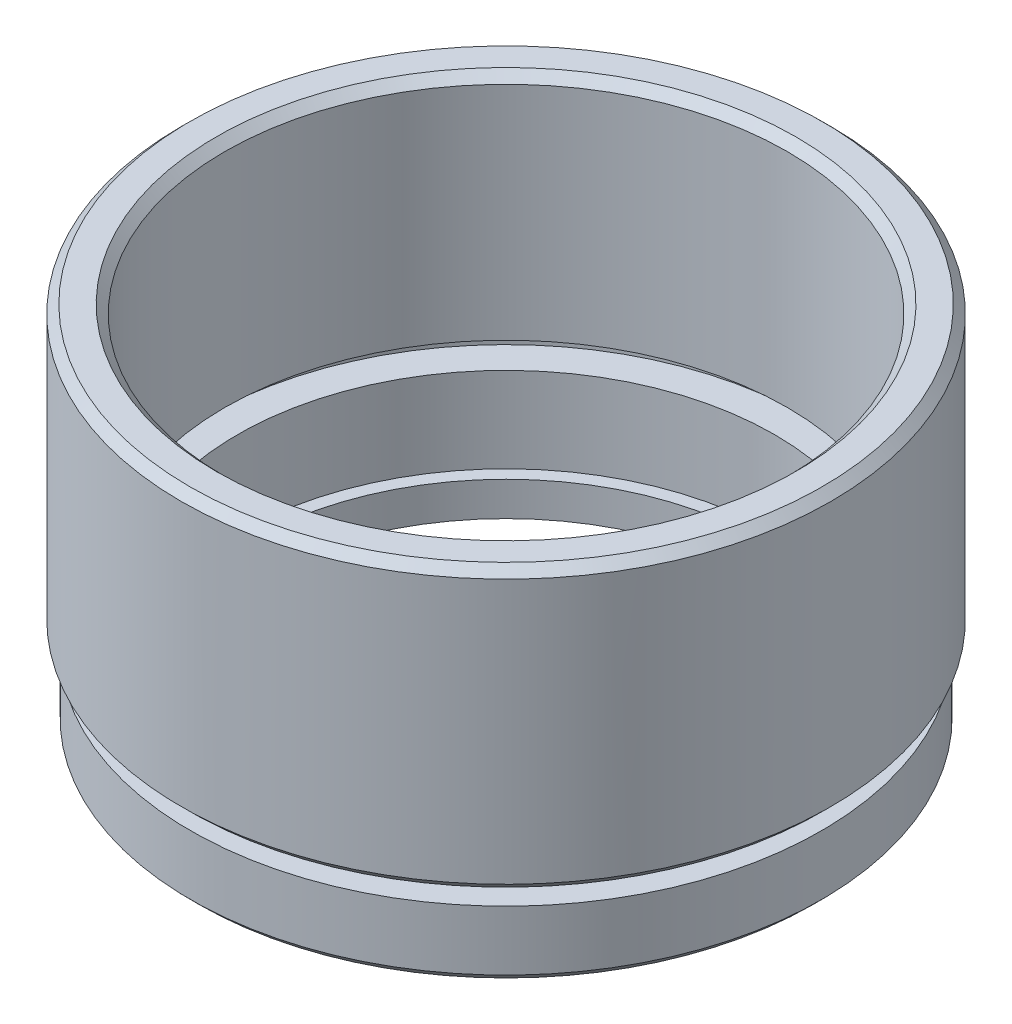
ISO-10303-21;
HEADER;
FILE_DESCRIPTION(('STEP AP214'),'2;1');
FILE_NAME('part.step','',(''),(''),'','','');
FILE_SCHEMA(('AUTOMOTIVE_DESIGN { 1 0 10303 214 1 1 1 1 }'));
ENDSEC;
DATA;
#1=APPLICATION_CONTEXT('core data for automotive mechanical design processes');
#2=APPLICATION_PROTOCOL_DEFINITION('international standard','automotive_design',2000,#1);
#3=PRODUCT_CONTEXT('',#1,'mechanical');
#4=PRODUCT('Part','Part','',(#3));
#5=PRODUCT_RELATED_PRODUCT_CATEGORY('part','',(#4));
#6=PRODUCT_DEFINITION_FORMATION('','',#4);
#7=PRODUCT_DEFINITION_CONTEXT('part definition',#1,'design');
#8=PRODUCT_DEFINITION('design','',#6,#7);
#9=PRODUCT_DEFINITION_SHAPE('','',#8);
#10=(LENGTH_UNIT() NAMED_UNIT(*) SI_UNIT(.MILLI.,.METRE.));
#11=(NAMED_UNIT(*) PLANE_ANGLE_UNIT() SI_UNIT($,.RADIAN.));
#12=(NAMED_UNIT(*) SI_UNIT($,.STERADIAN.) SOLID_ANGLE_UNIT());
#13=UNCERTAINTY_MEASURE_WITH_UNIT(LENGTH_MEASURE(1.E-05),#10,'distance_accuracy_value','');
#14=(GEOMETRIC_REPRESENTATION_CONTEXT(3) GLOBAL_UNCERTAINTY_ASSIGNED_CONTEXT((#13)) GLOBAL_UNIT_ASSIGNED_CONTEXT((#10,
#11,#12)) REPRESENTATION_CONTEXT('',''));
#15=CARTESIAN_POINT('',(0.,0.,0.));
#16=DIRECTION('',(0.,0.,1.));
#17=DIRECTION('',(1.,0.,0.));
#18=AXIS2_PLACEMENT_3D('',#15,#16,#17);
#19=CARTESIAN_POINT('',(0.,0.,0.));
#20=DIRECTION('',(0.,-1.,0.));
#21=DIRECTION('',(0.,0.,-1.));
#22=AXIS2_PLACEMENT_3D('',#19,#20,#21);
#23=CYLINDRICAL_SURFACE('',#22,15.);
#24=CARTESIAN_POINT('',(0.,0.,0.));
#25=DIRECTION('',(0.,-1.,0.));
#26=DIRECTION('',(0.,0.,-1.));
#27=AXIS2_PLACEMENT_3D('',#24,#25,#26);
#28=CIRCLE('',#27,15.);
#29=CARTESIAN_POINT('',(0.,0.,-15.));
#30=VERTEX_POINT('',#29);
#31=EDGE_CURVE('E67',#30,#30,#28,.T.);
#32=ORIENTED_EDGE('',*,*,#31,.T.);
#33=EDGE_LOOP('',(#32));
#34=FACE_BOUND('',#33,.T.);
#35=CARTESIAN_POINT('',(0.,2.,0.));
#36=DIRECTION('',(0.,-1.,0.));
#37=DIRECTION('',(0.,0.,-1.));
#38=AXIS2_PLACEMENT_3D('',#35,#36,#37);
#39=CIRCLE('',#38,15.);
#40=CARTESIAN_POINT('',(0.,2.,-15.));
#41=VERTEX_POINT('',#40);
#42=EDGE_CURVE('E94',#41,#41,#39,.T.);
#43=ORIENTED_EDGE('',*,*,#42,.F.);
#44=EDGE_LOOP('',(#43));
#45=FACE_BOUND('',#44,.T.);
#46=ADVANCED_FACE('F35',(#34,#45),#23,.F.);
#47=CARTESIAN_POINT('',(15.,0.,0.));
#48=DIRECTION('',(0.,-1.,0.));
#49=DIRECTION('',(0.,0.,-1.));
#50=AXIS2_PLACEMENT_3D('',#47,#48,#49);
#51=PLANE('',#50);
#52=CARTESIAN_POINT('',(0.,0.,0.));
#53=DIRECTION('',(0.,-1.,0.));
#54=DIRECTION('',(0.,0.,-1.));
#55=AXIS2_PLACEMENT_3D('',#52,#53,#54);
#56=CIRCLE('',#55,18.);
#57=CARTESIAN_POINT('',(0.,0.,-18.));
#58=VERTEX_POINT('',#57);
#59=EDGE_CURVE('E42',#58,#58,#56,.T.);
#60=ORIENTED_EDGE('',*,*,#59,.T.);
#61=EDGE_LOOP('',(#60));
#62=FACE_BOUND('',#61,.T.);
#63=ORIENTED_EDGE('',*,*,#31,.F.);
#64=EDGE_LOOP('',(#63));
#65=FACE_BOUND('',#64,.T.);
#66=ADVANCED_FACE('F102',(#62,#65),#51,.T.);
#67=CARTESIAN_POINT('',(0.,0.,0.));
#68=DIRECTION('',(0.,-1.,0.));
#69=DIRECTION('',(0.,0.,-1.));
#70=AXIS2_PLACEMENT_3D('',#67,#68,#69);
#71=CYLINDRICAL_SURFACE('',#70,18.5);
#72=CARTESIAN_POINT('',(0.,0.500000000000004,0.));
#73=DIRECTION('',(0.,-1.,0.));
#74=DIRECTION('',(0.,0.,-1.));
#75=AXIS2_PLACEMENT_3D('',#72,#73,#74);
#76=CIRCLE('',#75,18.5);
#77=CARTESIAN_POINT('',(0.,0.500000000000004,-18.5));
#78=VERTEX_POINT('',#77);
#79=EDGE_CURVE('E10',#78,#78,#76,.F.);
#80=ORIENTED_EDGE('',*,*,#79,.T.);
#81=EDGE_LOOP('',(#80));
#82=FACE_BOUND('',#81,.T.);
#83=CARTESIAN_POINT('',(0.,4.,0.));
#84=DIRECTION('',(0.,-1.,0.));
#85=DIRECTION('',(0.,0.,-1.));
#86=AXIS2_PLACEMENT_3D('',#83,#84,#85);
#87=CIRCLE('',#86,18.5);
#88=CARTESIAN_POINT('',(0.,4.,-18.5));
#89=VERTEX_POINT('',#88);
#90=EDGE_CURVE('E70',#89,#89,#87,.T.);
#91=ORIENTED_EDGE('',*,*,#90,.T.);
#92=EDGE_LOOP('',(#91));
#93=FACE_BOUND('',#92,.T.);
#94=ADVANCED_FACE('F108',(#82,#93),#71,.T.);
#95=CARTESIAN_POINT('',(18.5,4.,0.));
#96=DIRECTION('',(0.,1.,0.));
#97=DIRECTION('',(0.,0.,1.));
#98=AXIS2_PLACEMENT_3D('',#95,#96,#97);
#99=PLANE('',#98);
#100=CARTESIAN_POINT('',(0.,4.,0.));
#101=DIRECTION('',(0.,-1.,0.));
#102=DIRECTION('',(0.,0.,-1.));
#103=AXIS2_PLACEMENT_3D('',#100,#101,#102);
#104=CIRCLE('',#103,17.);
#105=CARTESIAN_POINT('',(0.,4.,-17.));
#106=VERTEX_POINT('',#105);
#107=EDGE_CURVE('E73',#106,#106,#104,.T.);
#108=ORIENTED_EDGE('',*,*,#107,.T.);
#109=EDGE_LOOP('',(#108));
#110=FACE_BOUND('',#109,.T.);
#111=ORIENTED_EDGE('',*,*,#90,.F.);
#112=EDGE_LOOP('',(#111));
#113=FACE_BOUND('',#112,.T.);
#114=ADVANCED_FACE('F140',(#110,#113),#99,.T.);
#115=CARTESIAN_POINT('',(0.,0.,0.));
#116=DIRECTION('',(0.,-1.,0.));
#117=DIRECTION('',(0.,0.,-1.));
#118=AXIS2_PLACEMENT_3D('',#115,#116,#117);
#119=CYLINDRICAL_SURFACE('',#118,17.);
#120=CARTESIAN_POINT('',(0.,5.,0.));
#121=DIRECTION('',(0.,-1.,0.));
#122=DIRECTION('',(0.,0.,-1.));
#123=AXIS2_PLACEMENT_3D('',#120,#121,#122);
#124=CIRCLE('',#123,17.);
#125=CARTESIAN_POINT('',(0.,5.,-17.));
#126=VERTEX_POINT('',#125);
#127=EDGE_CURVE('E76',#126,#126,#124,.T.);
#128=ORIENTED_EDGE('',*,*,#127,.T.);
#129=EDGE_LOOP('',(#128));
#130=FACE_BOUND('',#129,.T.);
#131=ORIENTED_EDGE('',*,*,#107,.F.);
#132=EDGE_LOOP('',(#131));
#133=FACE_BOUND('',#132,.T.);
#134=ADVANCED_FACE('F134',(#130,#133),#119,.T.);
#135=CARTESIAN_POINT('',(17.,5.,0.));
#136=DIRECTION('',(0.,-1.,0.));
#137=DIRECTION('',(0.,0.,-1.));
#138=AXIS2_PLACEMENT_3D('',#135,#136,#137);
#139=PLANE('',#138);
#140=CARTESIAN_POINT('',(0.,5.,0.));
#141=DIRECTION('',(0.,-1.,0.));
#142=DIRECTION('',(0.,0.,-1.));
#143=AXIS2_PLACEMENT_3D('',#140,#141,#142);
#144=CIRCLE('',#143,18.55);
#145=CARTESIAN_POINT('',(0.,5.,-18.55));
#146=VERTEX_POINT('',#145);
#147=EDGE_CURVE('E46',#146,#146,#144,.T.);
#148=ORIENTED_EDGE('',*,*,#147,.T.);
#149=EDGE_LOOP('',(#148));
#150=FACE_BOUND('',#149,.T.);
#151=ORIENTED_EDGE('',*,*,#127,.F.);
#152=EDGE_LOOP('',(#151));
#153=FACE_BOUND('',#152,.T.);
#154=ADVANCED_FACE('F130',(#150,#153),#139,.T.);
#155=CARTESIAN_POINT('',(0.,0.,0.));
#156=DIRECTION('',(0.,-1.,0.));
#157=DIRECTION('',(0.,0.,-1.));
#158=AXIS2_PLACEMENT_3D('',#155,#156,#157);
#159=CYLINDRICAL_SURFACE('',#158,19.05);
#160=CARTESIAN_POINT('',(0.,21.,0.));
#161=DIRECTION('',(0.,1.,0.));
#162=DIRECTION('',(0.,0.,1.));
#163=AXIS2_PLACEMENT_3D('',#160,#161,#162);
#164=CIRCLE('',#163,19.05);
#165=CARTESIAN_POINT('',(0.,21.,19.05));
#166=VERTEX_POINT('',#165);
#167=EDGE_CURVE('E50',#166,#166,#164,.F.);
#168=ORIENTED_EDGE('',*,*,#167,.T.);
#169=EDGE_LOOP('',(#168));
#170=FACE_BOUND('',#169,.T.);
#171=CARTESIAN_POINT('',(0.,5.49999999999998,0.));
#172=DIRECTION('',(0.,-1.,0.));
#173=DIRECTION('',(0.,0.,-1.));
#174=AXIS2_PLACEMENT_3D('',#171,#172,#173);
#175=CIRCLE('',#174,19.05);
#176=CARTESIAN_POINT('',(0.,5.49999999999998,-19.05));
#177=VERTEX_POINT('',#176);
#178=EDGE_CURVE('E55',#177,#177,#175,.F.);
#179=ORIENTED_EDGE('',*,*,#178,.T.);
#180=EDGE_LOOP('',(#179));
#181=FACE_BOUND('',#180,.T.);
#182=ADVANCED_FACE('F133',(#170,#181),#159,.T.);
#183=CARTESIAN_POINT('',(19.05,21.5,0.));
#184=DIRECTION('',(0.,1.,0.));
#185=DIRECTION('',(0.,0.,1.));
#186=AXIS2_PLACEMENT_3D('',#183,#184,#185);
#187=PLANE('',#186);
#188=CARTESIAN_POINT('',(0.,21.5,0.));
#189=DIRECTION('',(0.,1.,0.));
#190=DIRECTION('',(0.,0.,1.));
#191=AXIS2_PLACEMENT_3D('',#188,#189,#190);
#192=CIRCLE('',#191,17.);
#193=CARTESIAN_POINT('',(0.,21.5,17.));
#194=VERTEX_POINT('',#193);
#195=EDGE_CURVE('E61',#194,#194,#192,.F.);
#196=ORIENTED_EDGE('',*,*,#195,.T.);
#197=EDGE_LOOP('',(#196));
#198=FACE_BOUND('',#197,.T.);
#199=CARTESIAN_POINT('',(0.,21.5,0.));
#200=DIRECTION('',(0.,1.,0.));
#201=DIRECTION('',(0.,0.,1.));
#202=AXIS2_PLACEMENT_3D('',#199,#200,#201);
#203=CIRCLE('',#202,18.55);
#204=CARTESIAN_POINT('',(0.,21.5,18.55));
#205=VERTEX_POINT('',#204);
#206=EDGE_CURVE('E64',#205,#205,#203,.T.);
#207=ORIENTED_EDGE('',*,*,#206,.T.);
#208=EDGE_LOOP('',(#207));
#209=FACE_BOUND('',#208,.T.);
#210=ADVANCED_FACE('F155',(#198,#209),#187,.T.);
#211=CARTESIAN_POINT('',(0.,0.,0.));
#212=DIRECTION('',(0.,-1.,0.));
#213=DIRECTION('',(0.,0.,-1.));
#214=AXIS2_PLACEMENT_3D('',#211,#212,#213);
#215=CYLINDRICAL_SURFACE('',#214,16.5);
#216=CARTESIAN_POINT('',(0.,21.,0.));
#217=DIRECTION('',(0.,1.,0.));
#218=DIRECTION('',(0.,0.,1.));
#219=AXIS2_PLACEMENT_3D('',#216,#217,#218);
#220=CIRCLE('',#219,16.5);
#221=CARTESIAN_POINT('',(0.,21.,16.5));
#222=VERTEX_POINT('',#221);
#223=EDGE_CURVE('E58',#222,#222,#220,.T.);
#224=ORIENTED_EDGE('',*,*,#223,.T.);
#225=EDGE_LOOP('',(#224));
#226=FACE_BOUND('',#225,.T.);
#227=CARTESIAN_POINT('',(0.,8.,0.));
#228=DIRECTION('',(0.,-1.,0.));
#229=DIRECTION('',(0.,0.,-1.));
#230=AXIS2_PLACEMENT_3D('',#227,#228,#229);
#231=CIRCLE('',#230,16.5);
#232=CARTESIAN_POINT('',(0.,8.,-16.5));
#233=VERTEX_POINT('',#232);
#234=EDGE_CURVE('E79',#233,#233,#231,.T.);
#235=ORIENTED_EDGE('',*,*,#234,.T.);
#236=EDGE_LOOP('',(#235));
#237=FACE_BOUND('',#236,.T.);
#238=ADVANCED_FACE('F159',(#226,#237),#215,.F.);
#239=CARTESIAN_POINT('',(16.5,8.,0.));
#240=DIRECTION('',(0.,-1.,0.));
#241=DIRECTION('',(0.,0.,-1.));
#242=AXIS2_PLACEMENT_3D('',#239,#240,#241);
#243=PLANE('',#242);
#244=CARTESIAN_POINT('',(0.,8.,0.));
#245=DIRECTION('',(0.,-1.,0.));
#246=DIRECTION('',(0.,0.,-1.));
#247=AXIS2_PLACEMENT_3D('',#244,#245,#246);
#248=CIRCLE('',#247,17.6);
#249=CARTESIAN_POINT('',(0.,8.,-17.6));
#250=VERTEX_POINT('',#249);
#251=EDGE_CURVE('E82',#250,#250,#248,.T.);
#252=ORIENTED_EDGE('',*,*,#251,.T.);
#253=EDGE_LOOP('',(#252));
#254=FACE_BOUND('',#253,.T.);
#255=ORIENTED_EDGE('',*,*,#234,.F.);
#256=EDGE_LOOP('',(#255));
#257=FACE_BOUND('',#256,.T.);
#258=ADVANCED_FACE('F163',(#254,#257),#243,.T.);
#259=CARTESIAN_POINT('',(0.,0.,0.));
#260=DIRECTION('',(0.,-1.,0.));
#261=DIRECTION('',(0.,0.,-1.));
#262=AXIS2_PLACEMENT_3D('',#259,#260,#261);
#263=CYLINDRICAL_SURFACE('',#262,17.6);
#264=CARTESIAN_POINT('',(0.,7.,0.));
#265=DIRECTION('',(0.,-1.,0.));
#266=DIRECTION('',(0.,0.,-1.));
#267=AXIS2_PLACEMENT_3D('',#264,#265,#266);
#268=CIRCLE('',#267,17.6);
#269=CARTESIAN_POINT('',(0.,7.,-17.6));
#270=VERTEX_POINT('',#269);
#271=EDGE_CURVE('E85',#270,#270,#268,.T.);
#272=ORIENTED_EDGE('',*,*,#271,.T.);
#273=EDGE_LOOP('',(#272));
#274=FACE_BOUND('',#273,.T.);
#275=ORIENTED_EDGE('',*,*,#251,.F.);
#276=EDGE_LOOP('',(#275));
#277=FACE_BOUND('',#276,.T.);
#278=ADVANCED_FACE('F167',(#274,#277),#263,.F.);
#279=CARTESIAN_POINT('',(17.6,7.,0.));
#280=DIRECTION('',(0.,1.,0.));
#281=DIRECTION('',(0.,0.,1.));
#282=AXIS2_PLACEMENT_3D('',#279,#280,#281);
#283=PLANE('',#282);
#284=CARTESIAN_POINT('',(0.,7.,0.));
#285=DIRECTION('',(0.,-1.,0.));
#286=DIRECTION('',(0.,0.,-1.));
#287=AXIS2_PLACEMENT_3D('',#284,#285,#286);
#288=CIRCLE('',#287,15.75);
#289=CARTESIAN_POINT('',(0.,7.,-15.75));
#290=VERTEX_POINT('',#289);
#291=EDGE_CURVE('E88',#290,#290,#288,.T.);
#292=ORIENTED_EDGE('',*,*,#291,.T.);
#293=EDGE_LOOP('',(#292));
#294=FACE_BOUND('',#293,.T.);
#295=ORIENTED_EDGE('',*,*,#271,.F.);
#296=EDGE_LOOP('',(#295));
#297=FACE_BOUND('',#296,.T.);
#298=ADVANCED_FACE('F171',(#294,#297),#283,.T.);
#299=CARTESIAN_POINT('',(0.,0.,0.));
#300=DIRECTION('',(0.,-1.,0.));
#301=DIRECTION('',(0.,0.,-1.));
#302=AXIS2_PLACEMENT_3D('',#299,#300,#301);
#303=CYLINDRICAL_SURFACE('',#302,15.75);
#304=CARTESIAN_POINT('',(0.,2.,0.));
#305=DIRECTION('',(0.,-1.,0.));
#306=DIRECTION('',(0.,0.,-1.));
#307=AXIS2_PLACEMENT_3D('',#304,#305,#306);
#308=CIRCLE('',#307,15.75);
#309=CARTESIAN_POINT('',(0.,2.,-15.75));
#310=VERTEX_POINT('',#309);
#311=EDGE_CURVE('E91',#310,#310,#308,.T.);
#312=ORIENTED_EDGE('',*,*,#311,.T.);
#313=EDGE_LOOP('',(#312));
#314=FACE_BOUND('',#313,.T.);
#315=ORIENTED_EDGE('',*,*,#291,.F.);
#316=EDGE_LOOP('',(#315));
#317=FACE_BOUND('',#316,.T.);
#318=ADVANCED_FACE('F175',(#314,#317),#303,.F.);
#319=CARTESIAN_POINT('',(15.75,2.,0.));
#320=DIRECTION('',(0.,1.,0.));
#321=DIRECTION('',(0.,0.,1.));
#322=AXIS2_PLACEMENT_3D('',#319,#320,#321);
#323=PLANE('',#322);
#324=ORIENTED_EDGE('',*,*,#42,.T.);
#325=EDGE_LOOP('',(#324));
#326=FACE_BOUND('',#325,.T.);
#327=ORIENTED_EDGE('',*,*,#311,.F.);
#328=EDGE_LOOP('',(#327));
#329=FACE_BOUND('',#328,.T.);
#330=ADVANCED_FACE('F98',(#326,#329),#323,.T.);
#331=CARTESIAN_POINT('',(0.,21.5,0.));
#332=DIRECTION('',(0.,1.,0.));
#333=DIRECTION('',(0.,0.,1.));
#334=AXIS2_PLACEMENT_3D('',#331,#332,#333);
#335=CONICAL_SURFACE('',#334,17.,0.785398163397448);
#336=ORIENTED_EDGE('',*,*,#223,.F.);
#337=EDGE_LOOP('',(#336));
#338=FACE_BOUND('',#337,.T.);
#339=ORIENTED_EDGE('',*,*,#195,.F.);
#340=EDGE_LOOP('',(#339));
#341=FACE_BOUND('',#340,.T.);
#342=ADVANCED_FACE('F112',(#338,#341),#335,.F.);
#343=CARTESIAN_POINT('',(0.,21.,0.));
#344=DIRECTION('',(0.,-1.,0.));
#345=DIRECTION('',(0.,0.,-1.));
#346=AXIS2_PLACEMENT_3D('',#343,#344,#345);
#347=CONICAL_SURFACE('',#346,19.05,0.785398163397455);
#348=ORIENTED_EDGE('',*,*,#206,.F.);
#349=EDGE_LOOP('',(#348));
#350=FACE_BOUND('',#349,.T.);
#351=ORIENTED_EDGE('',*,*,#167,.F.);
#352=EDGE_LOOP('',(#351));
#353=FACE_BOUND('',#352,.T.);
#354=ADVANCED_FACE('F115',(#350,#353),#347,.T.);
#355=CARTESIAN_POINT('',(0.,5.,0.));
#356=DIRECTION('',(0.,1.,0.));
#357=DIRECTION('',(0.,0.,1.));
#358=AXIS2_PLACEMENT_3D('',#355,#356,#357);
#359=CONICAL_SURFACE('',#358,18.55,0.785398163397441);
#360=ORIENTED_EDGE('',*,*,#178,.F.);
#361=EDGE_LOOP('',(#360));
#362=FACE_BOUND('',#361,.T.);
#363=ORIENTED_EDGE('',*,*,#147,.F.);
#364=EDGE_LOOP('',(#363));
#365=FACE_BOUND('',#364,.T.);
#366=ADVANCED_FACE('F118',(#362,#365),#359,.T.);
#367=CARTESIAN_POINT('',(0.,0.,0.));
#368=DIRECTION('',(0.,1.,0.));
#369=DIRECTION('',(0.,0.,1.));
#370=AXIS2_PLACEMENT_3D('',#367,#368,#369);
#371=CONICAL_SURFACE('',#370,18.,0.785398163397438);
#372=ORIENTED_EDGE('',*,*,#79,.F.);
#373=EDGE_LOOP('',(#372));
#374=FACE_BOUND('',#373,.T.);
#375=ORIENTED_EDGE('',*,*,#59,.F.);
#376=EDGE_LOOP('',(#375));
#377=FACE_BOUND('',#376,.T.);
#378=ADVANCED_FACE('F37',(#374,#377),#371,.T.);
#379=CLOSED_SHELL('',(#46,#66,#94,#114,#134,#154,#182,#210,#238,#258,#278,#298,#318,#330,#342,
#354,#366,#378));
#380=MANIFOLD_SOLID_BREP('B2',#379);
#381=ADVANCED_BREP_SHAPE_REPRESENTATION('',(#18,#380),#14);
#382=SHAPE_DEFINITION_REPRESENTATION(#9,#381);
ENDSEC;
END-ISO-10303-21;
